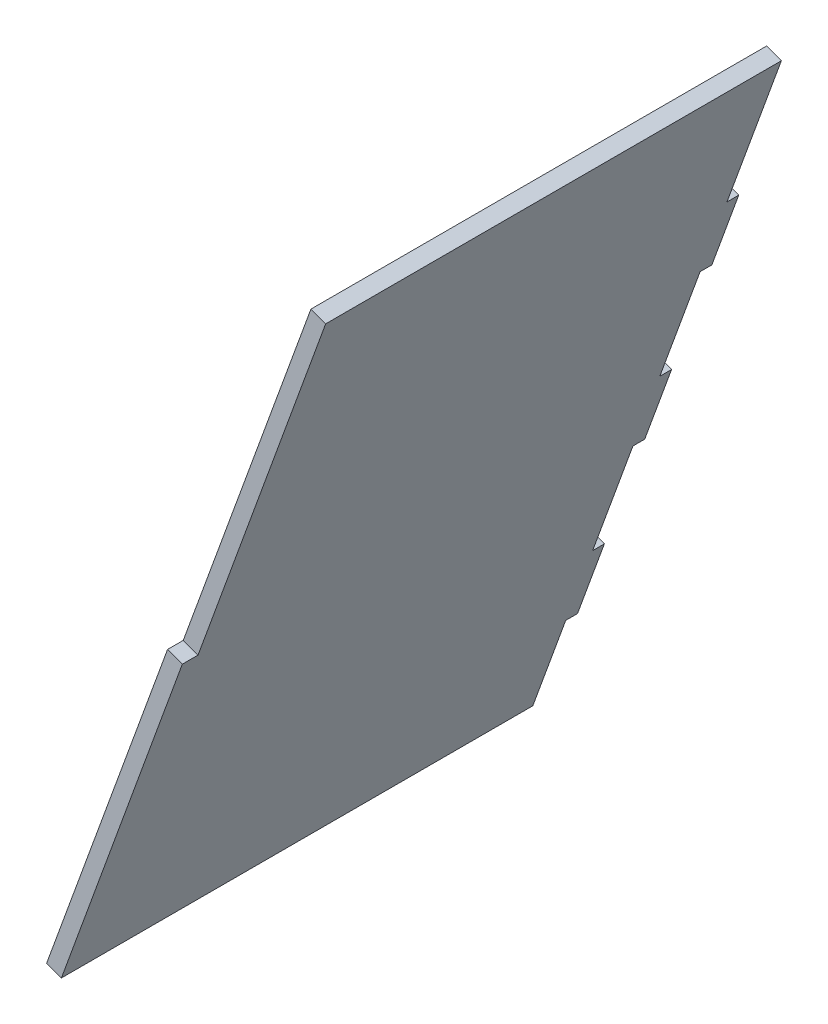
ISO-10303-21;
HEADER;
FILE_DESCRIPTION(('STEP AP214'),'2;1');
FILE_NAME('part.step','',(''),(''),'','','');
FILE_SCHEMA(('AUTOMOTIVE_DESIGN { 1 0 10303 214 1 1 1 1 }'));
ENDSEC;
DATA;
#1=APPLICATION_CONTEXT('core data for automotive mechanical design processes');
#2=APPLICATION_PROTOCOL_DEFINITION('international standard','automotive_design',2000,#1);
#3=PRODUCT_CONTEXT('',#1,'mechanical');
#4=PRODUCT('Part','Part','',(#3));
#5=PRODUCT_RELATED_PRODUCT_CATEGORY('part','',(#4));
#6=PRODUCT_DEFINITION_FORMATION('','',#4);
#7=PRODUCT_DEFINITION_CONTEXT('part definition',#1,'design');
#8=PRODUCT_DEFINITION('design','',#6,#7);
#9=PRODUCT_DEFINITION_SHAPE('','',#8);
#10=(LENGTH_UNIT() NAMED_UNIT(*) SI_UNIT(.MILLI.,.METRE.));
#11=(NAMED_UNIT(*) PLANE_ANGLE_UNIT() SI_UNIT($,.RADIAN.));
#12=(NAMED_UNIT(*) SI_UNIT($,.STERADIAN.) SOLID_ANGLE_UNIT());
#13=UNCERTAINTY_MEASURE_WITH_UNIT(LENGTH_MEASURE(1.E-05),#10,'distance_accuracy_value','');
#14=(GEOMETRIC_REPRESENTATION_CONTEXT(3) GLOBAL_UNCERTAINTY_ASSIGNED_CONTEXT((#13)) GLOBAL_UNIT_ASSIGNED_CONTEXT((#10,
#11,#12)) REPRESENTATION_CONTEXT('',''));
#15=CARTESIAN_POINT('',(0.,0.,0.));
#16=DIRECTION('',(0.,0.,1.));
#17=DIRECTION('',(1.,0.,0.));
#18=AXIS2_PLACEMENT_3D('',#15,#16,#17);
#19=CARTESIAN_POINT('',(-89.6204079462373,119.361120452036,120.));
#20=DIRECTION('',(-0.342020143325666,-0.93969262078591,0.));
#21=DIRECTION('',(0.,0.,-1.));
#22=AXIS2_PLACEMENT_3D('',#19,#20,#21);
#23=PLANE('',#22);
#24=DIRECTION('',(0.939692620785909,-0.342020143325666,0.));
#25=VECTOR('',#24,1.);
#26=CARTESIAN_POINT('',(-89.6204079462373,119.361120452036,116.));
#27=LINE('',#26,#25);
#28=CARTESIAN_POINT('',(-93.379178429381,120.729201025339,116.));
#29=VERTEX_POINT('',#28);
#30=CARTESIAN_POINT('',(-89.6204079462373,119.361120452036,116.));
#31=VERTEX_POINT('',#30);
#32=EDGE_CURVE('E11',#29,#31,#27,.T.);
#33=ORIENTED_EDGE('',*,*,#32,.F.);
#34=DIRECTION('',(0.,0.,1.));
#35=VECTOR('',#34,1.);
#36=CARTESIAN_POINT('',(-93.379178429381,120.729201025339,303.596177099471));
#37=LINE('',#36,#35);
#38=CARTESIAN_POINT('',(-93.379178429381,120.729201025339,120.));
#39=VERTEX_POINT('',#38);
#40=EDGE_CURVE('E134',#39,#29,#37,.F.);
#41=ORIENTED_EDGE('',*,*,#40,.F.);
#42=DIRECTION('',(0.939692620785909,-0.342020143325666,0.));
#43=VECTOR('',#42,1.);
#44=CARTESIAN_POINT('',(-89.6204079462373,119.361120452036,120.));
#45=LINE('',#44,#43);
#46=CARTESIAN_POINT('',(-89.6204079462373,119.361120452036,120.));
#47=VERTEX_POINT('',#46);
#48=EDGE_CURVE('E47',#39,#47,#45,.T.);
#49=ORIENTED_EDGE('',*,*,#48,.T.);
#50=DIRECTION('',(0.,0.,-1.));
#51=VECTOR('',#50,1.);
#52=CARTESIAN_POINT('',(-89.6204079462373,119.361120452036,120.));
#53=LINE('',#52,#51);
#54=EDGE_CURVE('E233',#47,#31,#53,.T.);
#55=ORIENTED_EDGE('',*,*,#54,.T.);
#56=EDGE_LOOP('',(#33,#41,#49,#55));
#57=FACE_BOUND('',#56,.T.);
#58=ADVANCED_FACE('F37',(#57),#23,.F.);
#59=CARTESIAN_POINT('',(-120.402220845547,34.7887845813041,120.));
#60=DIRECTION('',(0.,0.,-1.));
#61=DIRECTION('',(0.342020143325666,0.939692620785909,0.));
#62=AXIS2_PLACEMENT_3D('',#59,#60,#61);
#63=PLANE('',#62);
#64=ORIENTED_EDGE('',*,*,#48,.F.);
#65=DIRECTION('',(0.342020143325666,0.93969262078591,0.));
#66=VECTOR('',#65,1.);
#67=CARTESIAN_POINT('',(-60.8872648134428,210.,120.));
#68=LINE('',#67,#66);
#69=CARTESIAN_POINT('',(-124.160991328691,36.1568651546067,120.));
#70=VERTEX_POINT('',#69);
#71=EDGE_CURVE('E184',#70,#39,#68,.T.);
#72=ORIENTED_EDGE('',*,*,#71,.F.);
#73=DIRECTION('',(0.939692620785909,-0.342020143325666,0.));
#74=VECTOR('',#73,1.);
#75=CARTESIAN_POINT('',(-120.402220845547,34.7887845813041,120.));
#76=LINE('',#75,#74);
#77=CARTESIAN_POINT('',(-120.402220845547,34.7887845813041,120.));
#78=VERTEX_POINT('',#77);
#79=EDGE_CURVE('E226',#70,#78,#76,.T.);
#80=ORIENTED_EDGE('',*,*,#79,.T.);
#81=DIRECTION('',(0.342020143325666,0.939692620785909,0.));
#82=VECTOR('',#81,1.);
#83=CARTESIAN_POINT('',(-120.402220845547,34.7887845813041,120.));
#84=LINE('',#83,#82);
#85=EDGE_CURVE('E243',#78,#47,#84,.T.);
#86=ORIENTED_EDGE('',*,*,#85,.T.);
#87=EDGE_LOOP('',(#64,#72,#80,#86));
#88=FACE_BOUND('',#87,.T.);
#89=ADVANCED_FACE('F246',(#88),#63,.F.);
#90=CARTESIAN_POINT('',(-120.402220845547,34.788784581304,303.596177099471));
#91=DIRECTION('',(-0.342020143325666,-0.93969262078591,0.));
#92=DIRECTION('',(0.,0.,-1.));
#93=AXIS2_PLACEMENT_3D('',#90,#91,#92);
#94=PLANE('',#93);
#95=ORIENTED_EDGE('',*,*,#79,.F.);
#96=DIRECTION('',(0.,0.,1.));
#97=VECTOR('',#96,1.);
#98=CARTESIAN_POINT('',(-124.160991328691,36.1568651546067,303.596177099471));
#99=LINE('',#98,#97);
#100=CARTESIAN_POINT('',(-124.160991328691,36.1568651546066,0.));
#101=VERTEX_POINT('',#100);
#102=EDGE_CURVE('E181',#70,#101,#99,.F.);
#103=ORIENTED_EDGE('',*,*,#102,.T.);
#104=DIRECTION('',(0.939692620785909,-0.342020143325666,0.));
#105=VECTOR('',#104,1.);
#106=CARTESIAN_POINT('',(-120.402220845547,34.788784581304,0.));
#107=LINE('',#106,#105);
#108=CARTESIAN_POINT('',(-120.402220845547,34.788784581304,0.));
#109=VERTEX_POINT('',#108);
#110=EDGE_CURVE('E223',#101,#109,#107,.T.);
#111=ORIENTED_EDGE('',*,*,#110,.T.);
#112=DIRECTION('',(0.,0.,-1.));
#113=VECTOR('',#112,1.);
#114=CARTESIAN_POINT('',(-120.402220845547,34.788784581304,303.596177099471));
#115=LINE('',#114,#113);
#116=EDGE_CURVE('E247',#78,#109,#115,.T.);
#117=ORIENTED_EDGE('',*,*,#116,.F.);
#118=EDGE_LOOP('',(#95,#103,#111,#117));
#119=FACE_BOUND('',#118,.T.);
#120=ADVANCED_FACE('F352',(#119),#94,.T.);
#121=CARTESIAN_POINT('',(-57.1284943302991,208.631919426697,0.));
#122=DIRECTION('',(0.,0.,1.));
#123=DIRECTION('',(-0.342020143325666,-0.93969262078591,0.));
#124=AXIS2_PLACEMENT_3D('',#121,#122,#123);
#125=PLANE('',#124);
#126=ORIENTED_EDGE('',*,*,#110,.F.);
#127=DIRECTION('',(0.342020143325666,0.93969262078591,0.));
#128=VECTOR('',#127,1.);
#129=CARTESIAN_POINT('',(-60.8872648134428,210.,0.));
#130=LINE('',#129,#128);
#131=CARTESIAN_POINT('',(-115.781497817212,59.1793343638614,0.));
#132=VERTEX_POINT('',#131);
#133=EDGE_CURVE('E178',#132,#101,#130,.F.);
#134=ORIENTED_EDGE('',*,*,#133,.F.);
#135=DIRECTION('',(0.939692620785909,-0.342020143325666,0.));
#136=VECTOR('',#135,1.);
#137=CARTESIAN_POINT('',(-112.022727334068,57.8112537905588,0.));
#138=LINE('',#137,#136);
#139=CARTESIAN_POINT('',(-112.022727334068,57.8112537905588,0.));
#140=VERTEX_POINT('',#139);
#141=EDGE_CURVE('E220',#132,#140,#138,.T.);
#142=ORIENTED_EDGE('',*,*,#141,.T.);
#143=DIRECTION('',(-0.342020143325666,-0.93969262078591,0.));
#144=VECTOR('',#143,1.);
#145=CARTESIAN_POINT('',(-57.1284943302991,208.631919426697,0.));
#146=LINE('',#145,#144);
#147=EDGE_CURVE('E249',#140,#109,#146,.T.);
#148=ORIENTED_EDGE('',*,*,#147,.T.);
#149=EDGE_LOOP('',(#126,#134,#142,#148));
#150=FACE_BOUND('',#149,.T.);
#151=ADVANCED_FACE('F344',(#150),#125,.F.);
#152=CARTESIAN_POINT('',(-112.022727334068,57.8112537905588,-3.));
#153=DIRECTION('',(0.342020143325666,0.93969262078591,0.));
#154=DIRECTION('',(0.,0.,1.));
#155=AXIS2_PLACEMENT_3D('',#152,#153,#154);
#156=PLANE('',#155);
#157=ORIENTED_EDGE('',*,*,#141,.F.);
#158=DIRECTION('',(0.,0.,1.));
#159=VECTOR('',#158,1.);
#160=CARTESIAN_POINT('',(-115.781497817212,59.1793343638614,303.596177099471));
#161=LINE('',#160,#159);
#162=CARTESIAN_POINT('',(-115.781497817212,59.1793343638614,-3.));
#163=VERTEX_POINT('',#162);
#164=EDGE_CURVE('E175',#163,#132,#161,.T.);
#165=ORIENTED_EDGE('',*,*,#164,.F.);
#166=DIRECTION('',(0.939692620785909,-0.342020143325666,0.));
#167=VECTOR('',#166,1.);
#168=CARTESIAN_POINT('',(-112.022727334068,57.8112537905588,-3.));
#169=LINE('',#168,#167);
#170=CARTESIAN_POINT('',(-112.022727334068,57.8112537905588,-3.));
#171=VERTEX_POINT('',#170);
#172=EDGE_CURVE('E217',#163,#171,#169,.T.);
#173=ORIENTED_EDGE('',*,*,#172,.T.);
#174=DIRECTION('',(0.,0.,1.));
#175=VECTOR('',#174,1.);
#176=CARTESIAN_POINT('',(-112.022727334068,57.8112537905588,-3.));
#177=LINE('',#176,#175);
#178=EDGE_CURVE('E255',#171,#140,#177,.T.);
#179=ORIENTED_EDGE('',*,*,#178,.T.);
#180=EDGE_LOOP('',(#157,#165,#173,#179));
#181=FACE_BOUND('',#180,.T.);
#182=ADVANCED_FACE('F358',(#181),#156,.F.);
#183=CARTESIAN_POINT('',(-105.182324467555,76.605106206277,-3.));
#184=DIRECTION('',(0.,0.,1.));
#185=DIRECTION('',(-0.342020143325664,-0.93969262078591,0.));
#186=AXIS2_PLACEMENT_3D('',#183,#184,#185);
#187=PLANE('',#186);
#188=ORIENTED_EDGE('',*,*,#172,.F.);
#189=DIRECTION('',(0.342020143325666,0.93969262078591,0.));
#190=VECTOR('',#189,1.);
#191=CARTESIAN_POINT('',(-60.8872648134428,210.,-3.));
#192=LINE('',#191,#190);
#193=CARTESIAN_POINT('',(-108.941094950699,77.9731867795796,-3.));
#194=VERTEX_POINT('',#193);
#195=EDGE_CURVE('E172',#194,#163,#192,.F.);
#196=ORIENTED_EDGE('',*,*,#195,.F.);
#197=DIRECTION('',(0.939692620785909,-0.342020143325666,0.));
#198=VECTOR('',#197,1.);
#199=CARTESIAN_POINT('',(-105.182324467555,76.605106206277,-3.));
#200=LINE('',#199,#198);
#201=CARTESIAN_POINT('',(-105.182324467555,76.605106206277,-3.));
#202=VERTEX_POINT('',#201);
#203=EDGE_CURVE('E214',#194,#202,#200,.T.);
#204=ORIENTED_EDGE('',*,*,#203,.T.);
#205=DIRECTION('',(-0.342020143325664,-0.93969262078591,0.));
#206=VECTOR('',#205,1.);
#207=CARTESIAN_POINT('',(-105.182324467555,76.605106206277,-3.));
#208=LINE('',#207,#206);
#209=EDGE_CURVE('E259',#202,#171,#208,.T.);
#210=ORIENTED_EDGE('',*,*,#209,.T.);
#211=EDGE_LOOP('',(#188,#196,#204,#210));
#212=FACE_BOUND('',#211,.T.);
#213=ADVANCED_FACE('F361',(#212),#187,.F.);
#214=CARTESIAN_POINT('',(-105.182324467555,76.605106206277,-3.));
#215=DIRECTION('',(0.342020143325666,0.93969262078591,0.));
#216=DIRECTION('',(0.,0.,1.));
#217=AXIS2_PLACEMENT_3D('',#214,#215,#216);
#218=PLANE('',#217);
#219=ORIENTED_EDGE('',*,*,#203,.F.);
#220=DIRECTION('',(0.,0.,1.));
#221=VECTOR('',#220,1.);
#222=CARTESIAN_POINT('',(-108.941094950699,77.9731867795796,303.596177099471));
#223=LINE('',#222,#221);
#224=CARTESIAN_POINT('',(-108.941094950699,77.9731867795796,0.));
#225=VERTEX_POINT('',#224);
#226=EDGE_CURVE('E169',#194,#225,#223,.T.);
#227=ORIENTED_EDGE('',*,*,#226,.T.);
#228=DIRECTION('',(0.939692620785909,-0.342020143325666,0.));
#229=VECTOR('',#228,1.);
#230=CARTESIAN_POINT('',(-105.182324467555,76.6051062062769,0.));
#231=LINE('',#230,#229);
#232=CARTESIAN_POINT('',(-105.182324467555,76.6051062062769,0.));
#233=VERTEX_POINT('',#232);
#234=EDGE_CURVE('E211',#225,#233,#231,.T.);
#235=ORIENTED_EDGE('',*,*,#234,.T.);
#236=DIRECTION('',(0.,0.,1.));
#237=VECTOR('',#236,1.);
#238=CARTESIAN_POINT('',(-105.182324467555,76.605106206277,-3.));
#239=LINE('',#238,#237);
#240=EDGE_CURVE('E262',#202,#233,#239,.T.);
#241=ORIENTED_EDGE('',*,*,#240,.F.);
#242=EDGE_LOOP('',(#219,#227,#235,#241));
#243=FACE_BOUND('',#242,.T.);
#244=ADVANCED_FACE('F346',(#243),#218,.T.);
#245=ORIENTED_EDGE('',*,*,#234,.F.);
#246=DIRECTION('',(0.342020143325666,0.93969262078591,0.));
#247=VECTOR('',#246,1.);
#248=CARTESIAN_POINT('',(-60.8872648134428,210.,0.));
#249=LINE('',#248,#247);
#250=CARTESIAN_POINT('',(-98.6804906509288,106.163965403157,0.));
#251=VERTEX_POINT('',#250);
#252=EDGE_CURVE('E166',#251,#225,#249,.F.);
#253=ORIENTED_EDGE('',*,*,#252,.F.);
#254=DIRECTION('',(0.939692620785909,-0.342020143325666,0.));
#255=VECTOR('',#254,1.);
#256=CARTESIAN_POINT('',(-94.9217201677852,104.795884829854,0.));
#257=LINE('',#256,#255);
#258=CARTESIAN_POINT('',(-94.9217201677852,104.795884829854,0.));
#259=VERTEX_POINT('',#258);
#260=EDGE_CURVE('E208',#251,#259,#257,.T.);
#261=ORIENTED_EDGE('',*,*,#260,.T.);
#262=EDGE_CURVE('E256',#259,#233,#146,.T.);
#263=ORIENTED_EDGE('',*,*,#262,.T.);
#264=EDGE_LOOP('',(#245,#253,#261,#263));
#265=FACE_BOUND('',#264,.T.);
#266=ADVANCED_FACE('F293',(#265),#125,.F.);
#267=CARTESIAN_POINT('',(-94.9217201677852,104.795884829854,-3.));
#268=DIRECTION('',(0.342020143325666,0.93969262078591,0.));
#269=DIRECTION('',(0.,0.,1.));
#270=AXIS2_PLACEMENT_3D('',#267,#268,#269);
#271=PLANE('',#270);
#272=ORIENTED_EDGE('',*,*,#260,.F.);
#273=DIRECTION('',(0.,0.,1.));
#274=VECTOR('',#273,1.);
#275=CARTESIAN_POINT('',(-98.6804906509288,106.163965403157,303.596177099471));
#276=LINE('',#275,#274);
#277=CARTESIAN_POINT('',(-98.6804906509288,106.163965403157,-3.));
#278=VERTEX_POINT('',#277);
#279=EDGE_CURVE('E163',#278,#251,#276,.T.);
#280=ORIENTED_EDGE('',*,*,#279,.F.);
#281=DIRECTION('',(0.939692620785909,-0.342020143325666,0.));
#282=VECTOR('',#281,1.);
#283=CARTESIAN_POINT('',(-94.9217201677852,104.795884829854,-3.));
#284=LINE('',#283,#282);
#285=CARTESIAN_POINT('',(-94.9217201677852,104.795884829854,-3.));
#286=VERTEX_POINT('',#285);
#287=EDGE_CURVE('E205',#278,#286,#284,.T.);
#288=ORIENTED_EDGE('',*,*,#287,.T.);
#289=DIRECTION('',(0.,0.,1.));
#290=VECTOR('',#289,1.);
#291=CARTESIAN_POINT('',(-94.9217201677852,104.795884829854,-3.));
#292=LINE('',#291,#290);
#293=EDGE_CURVE('E265',#286,#259,#292,.T.);
#294=ORIENTED_EDGE('',*,*,#293,.T.);
#295=EDGE_LOOP('',(#272,#280,#288,#294));
#296=FACE_BOUND('',#295,.T.);
#297=ADVANCED_FACE('F305',(#296),#271,.F.);
#298=CARTESIAN_POINT('',(-88.0813173012719,123.589737245572,-3.));
#299=DIRECTION('',(0.,0.,1.));
#300=DIRECTION('',(-0.342020143325665,-0.93969262078591,0.));
#301=AXIS2_PLACEMENT_3D('',#298,#299,#300);
#302=PLANE('',#301);
#303=ORIENTED_EDGE('',*,*,#287,.F.);
#304=DIRECTION('',(0.342020143325666,0.93969262078591,0.));
#305=VECTOR('',#304,1.);
#306=CARTESIAN_POINT('',(-60.8872648134428,210.,-3.));
#307=LINE('',#306,#305);
#308=CARTESIAN_POINT('',(-91.8400877844155,124.957817818875,-3.));
#309=VERTEX_POINT('',#308);
#310=EDGE_CURVE('E160',#309,#278,#307,.F.);
#311=ORIENTED_EDGE('',*,*,#310,.F.);
#312=DIRECTION('',(0.939692620785909,-0.342020143325666,0.));
#313=VECTOR('',#312,1.);
#314=CARTESIAN_POINT('',(-88.0813173012719,123.589737245572,-3.));
#315=LINE('',#314,#313);
#316=CARTESIAN_POINT('',(-88.0813173012719,123.589737245572,-3.));
#317=VERTEX_POINT('',#316);
#318=EDGE_CURVE('E202',#309,#317,#315,.T.);
#319=ORIENTED_EDGE('',*,*,#318,.T.);
#320=DIRECTION('',(-0.342020143325665,-0.93969262078591,0.));
#321=VECTOR('',#320,1.);
#322=CARTESIAN_POINT('',(-88.0813173012719,123.589737245572,-3.));
#323=LINE('',#322,#321);
#324=EDGE_CURVE('E268',#317,#286,#323,.T.);
#325=ORIENTED_EDGE('',*,*,#324,.T.);
#326=EDGE_LOOP('',(#303,#311,#319,#325));
#327=FACE_BOUND('',#326,.T.);
#328=ADVANCED_FACE('F311',(#327),#302,.F.);
#329=CARTESIAN_POINT('',(-88.0813173012719,123.589737245572,-3.));
#330=DIRECTION('',(0.342020143325666,0.93969262078591,0.));
#331=DIRECTION('',(0.,0.,1.));
#332=AXIS2_PLACEMENT_3D('',#329,#330,#331);
#333=PLANE('',#332);
#334=ORIENTED_EDGE('',*,*,#318,.F.);
#335=DIRECTION('',(0.,0.,1.));
#336=VECTOR('',#335,1.);
#337=CARTESIAN_POINT('',(-91.8400877844155,124.957817818875,303.596177099471));
#338=LINE('',#337,#336);
#339=CARTESIAN_POINT('',(-91.8400877844155,124.957817818875,0.));
#340=VERTEX_POINT('',#339);
#341=EDGE_CURVE('E157',#309,#340,#338,.T.);
#342=ORIENTED_EDGE('',*,*,#341,.T.);
#343=DIRECTION('',(0.939692620785909,-0.342020143325666,0.));
#344=VECTOR('',#343,1.);
#345=CARTESIAN_POINT('',(-88.0813173012719,123.589737245572,0.));
#346=LINE('',#345,#344);
#347=CARTESIAN_POINT('',(-88.0813173012719,123.589737245572,0.));
#348=VERTEX_POINT('',#347);
#349=EDGE_CURVE('E199',#340,#348,#346,.T.);
#350=ORIENTED_EDGE('',*,*,#349,.T.);
#351=DIRECTION('',(0.,0.,1.));
#352=VECTOR('',#351,1.);
#353=CARTESIAN_POINT('',(-88.0813173012719,123.589737245572,-3.));
#354=LINE('',#353,#352);
#355=EDGE_CURVE('E271',#317,#348,#354,.T.);
#356=ORIENTED_EDGE('',*,*,#355,.F.);
#357=EDGE_LOOP('',(#334,#342,#350,#356));
#358=FACE_BOUND('',#357,.T.);
#359=ADVANCED_FACE('F315',(#358),#333,.T.);
#360=ORIENTED_EDGE('',*,*,#349,.F.);
#361=DIRECTION('',(0.342020143325666,0.93969262078591,0.));
#362=VECTOR('',#361,1.);
#363=CARTESIAN_POINT('',(-60.8872648134428,210.,0.));
#364=LINE('',#363,#362);
#365=CARTESIAN_POINT('',(-81.5794834846455,153.148596442452,0.));
#366=VERTEX_POINT('',#365);
#367=EDGE_CURVE('E154',#366,#340,#364,.F.);
#368=ORIENTED_EDGE('',*,*,#367,.F.);
#369=DIRECTION('',(0.939692620785909,-0.342020143325666,0.));
#370=VECTOR('',#369,1.);
#371=CARTESIAN_POINT('',(-77.8207130015019,151.78051586915,0.));
#372=LINE('',#371,#370);
#373=CARTESIAN_POINT('',(-77.8207130015019,151.78051586915,0.));
#374=VERTEX_POINT('',#373);
#375=EDGE_CURVE('E196',#366,#374,#372,.T.);
#376=ORIENTED_EDGE('',*,*,#375,.T.);
#377=EDGE_CURVE('E274',#374,#348,#146,.T.);
#378=ORIENTED_EDGE('',*,*,#377,.T.);
#379=EDGE_LOOP('',(#360,#368,#376,#378));
#380=FACE_BOUND('',#379,.T.);
#381=ADVANCED_FACE('F332',(#380),#125,.F.);
#382=CARTESIAN_POINT('',(-77.8207130015019,151.78051586915,-3.));
#383=DIRECTION('',(0.342020143325666,0.93969262078591,0.));
#384=DIRECTION('',(0.,0.,1.));
#385=AXIS2_PLACEMENT_3D('',#382,#383,#384);
#386=PLANE('',#385);
#387=ORIENTED_EDGE('',*,*,#375,.F.);
#388=DIRECTION('',(0.,0.,1.));
#389=VECTOR('',#388,1.);
#390=CARTESIAN_POINT('',(-81.5794834846455,153.148596442452,303.596177099471));
#391=LINE('',#390,#389);
#392=CARTESIAN_POINT('',(-81.5794834846455,153.148596442452,-3.));
#393=VERTEX_POINT('',#392);
#394=EDGE_CURVE('E151',#393,#366,#391,.T.);
#395=ORIENTED_EDGE('',*,*,#394,.F.);
#396=DIRECTION('',(0.939692620785909,-0.342020143325666,0.));
#397=VECTOR('',#396,1.);
#398=CARTESIAN_POINT('',(-77.8207130015019,151.78051586915,-3.));
#399=LINE('',#398,#397);
#400=CARTESIAN_POINT('',(-77.8207130015019,151.78051586915,-3.));
#401=VERTEX_POINT('',#400);
#402=EDGE_CURVE('E193',#393,#401,#399,.T.);
#403=ORIENTED_EDGE('',*,*,#402,.T.);
#404=DIRECTION('',(0.,0.,1.));
#405=VECTOR('',#404,1.);
#406=CARTESIAN_POINT('',(-77.8207130015019,151.78051586915,-3.));
#407=LINE('',#406,#405);
#408=EDGE_CURVE('E275',#401,#374,#407,.T.);
#409=ORIENTED_EDGE('',*,*,#408,.T.);
#410=EDGE_LOOP('',(#387,#395,#403,#409));
#411=FACE_BOUND('',#410,.T.);
#412=ADVANCED_FACE('F331',(#411),#386,.F.);
#413=CARTESIAN_POINT('',(-70.9803101349886,170.574368284868,-3.));
#414=DIRECTION('',(0.,0.,1.));
#415=DIRECTION('',(-0.342020143325666,-0.939692620785909,0.));
#416=AXIS2_PLACEMENT_3D('',#413,#414,#415);
#417=PLANE('',#416);
#418=ORIENTED_EDGE('',*,*,#402,.F.);
#419=DIRECTION('',(0.342020143325666,0.93969262078591,0.));
#420=VECTOR('',#419,1.);
#421=CARTESIAN_POINT('',(-60.8872648134428,210.,-3.));
#422=LINE('',#421,#420);
#423=CARTESIAN_POINT('',(-74.7390806181322,171.942448858171,-3.));
#424=VERTEX_POINT('',#423);
#425=EDGE_CURVE('E148',#424,#393,#422,.F.);
#426=ORIENTED_EDGE('',*,*,#425,.F.);
#427=DIRECTION('',(0.939692620785909,-0.342020143325666,0.));
#428=VECTOR('',#427,1.);
#429=CARTESIAN_POINT('',(-70.9803101349886,170.574368284868,-3.));
#430=LINE('',#429,#428);
#431=CARTESIAN_POINT('',(-70.9803101349886,170.574368284868,-3.));
#432=VERTEX_POINT('',#431);
#433=EDGE_CURVE('E190',#424,#432,#430,.T.);
#434=ORIENTED_EDGE('',*,*,#433,.T.);
#435=DIRECTION('',(-0.342020143325666,-0.939692620785909,0.));
#436=VECTOR('',#435,1.);
#437=CARTESIAN_POINT('',(-70.9803101349886,170.574368284868,-3.));
#438=LINE('',#437,#436);
#439=EDGE_CURVE('E277',#432,#401,#438,.T.);
#440=ORIENTED_EDGE('',*,*,#439,.T.);
#441=EDGE_LOOP('',(#418,#426,#434,#440));
#442=FACE_BOUND('',#441,.T.);
#443=ADVANCED_FACE('F324',(#442),#417,.F.);
#444=CARTESIAN_POINT('',(-70.9803101349886,170.574368284868,-3.));
#445=DIRECTION('',(0.342020143325666,0.93969262078591,0.));
#446=DIRECTION('',(0.,0.,1.));
#447=AXIS2_PLACEMENT_3D('',#444,#445,#446);
#448=PLANE('',#447);
#449=ORIENTED_EDGE('',*,*,#433,.F.);
#450=DIRECTION('',(0.,0.,1.));
#451=VECTOR('',#450,1.);
#452=CARTESIAN_POINT('',(-74.7390806181322,171.942448858171,303.596177099471));
#453=LINE('',#452,#451);
#454=CARTESIAN_POINT('',(-74.7390806181322,171.942448858171,0.));
#455=VERTEX_POINT('',#454);
#456=EDGE_CURVE('E145',#424,#455,#453,.T.);
#457=ORIENTED_EDGE('',*,*,#456,.T.);
#458=DIRECTION('',(0.939692620785909,-0.342020143325666,0.));
#459=VECTOR('',#458,1.);
#460=CARTESIAN_POINT('',(-70.9803101349886,170.574368284868,0.));
#461=LINE('',#460,#459);
#462=CARTESIAN_POINT('',(-70.9803101349886,170.574368284868,0.));
#463=VERTEX_POINT('',#462);
#464=EDGE_CURVE('E188',#455,#463,#461,.T.);
#465=ORIENTED_EDGE('',*,*,#464,.T.);
#466=DIRECTION('',(0.,0.,1.));
#467=VECTOR('',#466,1.);
#468=CARTESIAN_POINT('',(-70.9803101349886,170.574368284868,-3.));
#469=LINE('',#468,#467);
#470=EDGE_CURVE('E140',#432,#463,#469,.T.);
#471=ORIENTED_EDGE('',*,*,#470,.F.);
#472=EDGE_LOOP('',(#449,#457,#465,#471));
#473=FACE_BOUND('',#472,.T.);
#474=ADVANCED_FACE('F327',(#473),#448,.T.);
#475=ORIENTED_EDGE('',*,*,#464,.F.);
#476=DIRECTION('',(0.342020143325666,0.93969262078591,0.));
#477=VECTOR('',#476,1.);
#478=CARTESIAN_POINT('',(-60.8872648134428,210.,0.));
#479=LINE('',#478,#477);
#480=CARTESIAN_POINT('',(-60.8872648134428,210.,0.));
#481=VERTEX_POINT('',#480);
#482=EDGE_CURVE('E142',#481,#455,#479,.F.);
#483=ORIENTED_EDGE('',*,*,#482,.F.);
#484=DIRECTION('',(0.939692620785909,-0.342020143325666,0.));
#485=VECTOR('',#484,1.);
#486=CARTESIAN_POINT('',(-57.1284943302991,208.631919426697,0.));
#487=LINE('',#486,#485);
#488=CARTESIAN_POINT('',(-57.1284943302991,208.631919426697,0.));
#489=VERTEX_POINT('',#488);
#490=EDGE_CURVE('E55',#481,#489,#487,.T.);
#491=ORIENTED_EDGE('',*,*,#490,.T.);
#492=EDGE_CURVE('E127',#489,#463,#146,.T.);
#493=ORIENTED_EDGE('',*,*,#492,.T.);
#494=EDGE_LOOP('',(#475,#483,#491,#493));
#495=FACE_BOUND('',#494,.T.);
#496=ADVANCED_FACE('F328',(#495),#125,.F.);
#497=CARTESIAN_POINT('',(-57.1284943302991,208.631919426697,303.596177099471));
#498=DIRECTION('',(-0.342020143325666,-0.93969262078591,0.));
#499=DIRECTION('',(0.,0.,-1.));
#500=AXIS2_PLACEMENT_3D('',#497,#498,#499);
#501=PLANE('',#500);
#502=ORIENTED_EDGE('',*,*,#490,.F.);
#503=DIRECTION('',(0.,0.,1.));
#504=VECTOR('',#503,1.);
#505=CARTESIAN_POINT('',(-60.8872648134428,210.,303.596177099471));
#506=LINE('',#505,#504);
#507=CARTESIAN_POINT('',(-60.8872648134428,210.,116.));
#508=VERTEX_POINT('',#507);
#509=EDGE_CURVE('E132',#508,#481,#506,.F.);
#510=ORIENTED_EDGE('',*,*,#509,.F.);
#511=DIRECTION('',(0.939692620785909,-0.342020143325666,0.));
#512=VECTOR('',#511,1.);
#513=CARTESIAN_POINT('',(-57.1284943302991,208.631919426697,116.));
#514=LINE('',#513,#512);
#515=CARTESIAN_POINT('',(-57.1284943302991,208.631919426697,116.));
#516=VERTEX_POINT('',#515);
#517=EDGE_CURVE('E41',#508,#516,#514,.T.);
#518=ORIENTED_EDGE('',*,*,#517,.T.);
#519=DIRECTION('',(0.,0.,-1.));
#520=VECTOR('',#519,1.);
#521=CARTESIAN_POINT('',(-57.1284943302991,208.631919426697,303.596177099471));
#522=LINE('',#521,#520);
#523=EDGE_CURVE('E144',#516,#489,#522,.T.);
#524=ORIENTED_EDGE('',*,*,#523,.T.);
#525=EDGE_LOOP('',(#502,#510,#518,#524));
#526=FACE_BOUND('',#525,.T.);
#527=ADVANCED_FACE('F136',(#526),#501,.F.);
#528=CARTESIAN_POINT('',(-57.1284943302991,208.631919426697,116.));
#529=DIRECTION('',(0.,0.,-1.));
#530=DIRECTION('',(0.342020143325666,0.93969262078591,0.));
#531=AXIS2_PLACEMENT_3D('',#528,#529,#530);
#532=PLANE('',#531);
#533=DIRECTION('',(0.342020143325666,0.93969262078591,0.));
#534=VECTOR('',#533,1.);
#535=CARTESIAN_POINT('',(-60.8872648134428,210.,116.));
#536=LINE('',#535,#534);
#537=EDGE_CURVE('E121',#29,#508,#536,.T.);
#538=ORIENTED_EDGE('',*,*,#537,.F.);
#539=ORIENTED_EDGE('',*,*,#32,.T.);
#540=DIRECTION('',(0.342020143325666,0.93969262078591,0.));
#541=VECTOR('',#540,1.);
#542=CARTESIAN_POINT('',(-57.1284943302991,208.631919426697,116.));
#543=LINE('',#542,#541);
#544=EDGE_CURVE('E123',#31,#516,#543,.T.);
#545=ORIENTED_EDGE('',*,*,#544,.T.);
#546=ORIENTED_EDGE('',*,*,#517,.F.);
#547=EDGE_LOOP('',(#538,#539,#545,#546));
#548=FACE_BOUND('',#547,.T.);
#549=ADVANCED_FACE('F39',(#548),#532,.F.);
#550=CARTESIAN_POINT('',(-57.1284943302991,208.631919426697,303.596177099471));
#551=DIRECTION('',(0.939692620785909,-0.342020143325666,0.));
#552=DIRECTION('',(0.342020143325666,0.93969262078591,0.));
#553=AXIS2_PLACEMENT_3D('',#550,#551,#552);
#554=PLANE('',#553);
#555=ORIENTED_EDGE('',*,*,#523,.F.);
#556=ORIENTED_EDGE('',*,*,#544,.F.);
#557=ORIENTED_EDGE('',*,*,#54,.F.);
#558=ORIENTED_EDGE('',*,*,#85,.F.);
#559=ORIENTED_EDGE('',*,*,#116,.T.);
#560=ORIENTED_EDGE('',*,*,#147,.F.);
#561=ORIENTED_EDGE('',*,*,#178,.F.);
#562=ORIENTED_EDGE('',*,*,#209,.F.);
#563=ORIENTED_EDGE('',*,*,#240,.T.);
#564=ORIENTED_EDGE('',*,*,#262,.F.);
#565=ORIENTED_EDGE('',*,*,#293,.F.);
#566=ORIENTED_EDGE('',*,*,#324,.F.);
#567=ORIENTED_EDGE('',*,*,#355,.T.);
#568=ORIENTED_EDGE('',*,*,#377,.F.);
#569=ORIENTED_EDGE('',*,*,#408,.F.);
#570=ORIENTED_EDGE('',*,*,#439,.F.);
#571=ORIENTED_EDGE('',*,*,#470,.T.);
#572=ORIENTED_EDGE('',*,*,#492,.F.);
#573=EDGE_LOOP('',(#555,#556,#557,#558,#559,#560,#561,#562,#563,#564,#565,#566,#567,#568,#569,
#570,#571,#572));
#574=FACE_BOUND('',#573,.T.);
#575=ADVANCED_FACE('F241',(#574),#554,.T.);
#576=CARTESIAN_POINT('',(-60.8872648134428,210.,303.596177099471));
#577=DIRECTION('',(0.939692620785909,-0.342020143325666,0.));
#578=DIRECTION('',(0.342020143325666,0.93969262078591,0.));
#579=AXIS2_PLACEMENT_3D('',#576,#577,#578);
#580=PLANE('',#579);
#581=ORIENTED_EDGE('',*,*,#509,.T.);
#582=ORIENTED_EDGE('',*,*,#482,.T.);
#583=ORIENTED_EDGE('',*,*,#456,.F.);
#584=ORIENTED_EDGE('',*,*,#425,.T.);
#585=ORIENTED_EDGE('',*,*,#394,.T.);
#586=ORIENTED_EDGE('',*,*,#367,.T.);
#587=ORIENTED_EDGE('',*,*,#341,.F.);
#588=ORIENTED_EDGE('',*,*,#310,.T.);
#589=ORIENTED_EDGE('',*,*,#279,.T.);
#590=ORIENTED_EDGE('',*,*,#252,.T.);
#591=ORIENTED_EDGE('',*,*,#226,.F.);
#592=ORIENTED_EDGE('',*,*,#195,.T.);
#593=ORIENTED_EDGE('',*,*,#164,.T.);
#594=ORIENTED_EDGE('',*,*,#133,.T.);
#595=ORIENTED_EDGE('',*,*,#102,.F.);
#596=ORIENTED_EDGE('',*,*,#71,.T.);
#597=ORIENTED_EDGE('',*,*,#40,.T.);
#598=ORIENTED_EDGE('',*,*,#537,.T.);
#599=EDGE_LOOP('',(#581,#582,#583,#584,#585,#586,#587,#588,#589,#590,#591,#592,#593,#594,#595,
#596,#597,#598));
#600=FACE_BOUND('',#599,.T.);
#601=ADVANCED_FACE('F130',(#600),#580,.F.);
#602=CLOSED_SHELL('',(#58,#89,#120,#151,#182,#213,#244,#266,#297,#328,#359,#381,#412,#443,#474,
#496,#527,#549,#575,#601));
#603=MANIFOLD_SOLID_BREP('B2',#602);
#604=ADVANCED_BREP_SHAPE_REPRESENTATION('',(#18,#603),#14);
#605=SHAPE_DEFINITION_REPRESENTATION(#9,#604);
ENDSEC;
END-ISO-10303-21;
